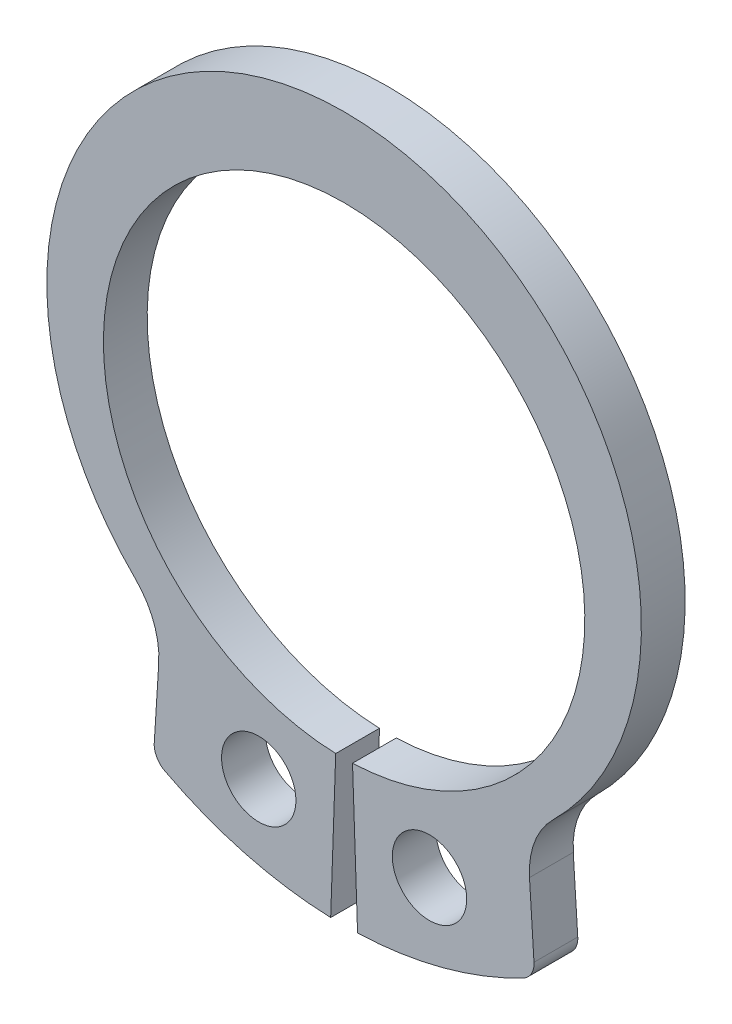
ISO-10303-21;
HEADER;
FILE_DESCRIPTION(('STEP AP214'),'2;1');
FILE_NAME('part.step','',(''),(''),'','','');
FILE_SCHEMA(('AUTOMOTIVE_DESIGN { 1 0 10303 214 1 1 1 1 }'));
ENDSEC;
DATA;
#1=APPLICATION_CONTEXT('core data for automotive mechanical design processes');
#2=APPLICATION_PROTOCOL_DEFINITION('international standard','automotive_design',2000,#1);
#3=PRODUCT_CONTEXT('',#1,'mechanical');
#4=PRODUCT('Part','Part','',(#3));
#5=PRODUCT_RELATED_PRODUCT_CATEGORY('part','',(#4));
#6=PRODUCT_DEFINITION_FORMATION('','',#4);
#7=PRODUCT_DEFINITION_CONTEXT('part definition',#1,'design');
#8=PRODUCT_DEFINITION('design','',#6,#7);
#9=PRODUCT_DEFINITION_SHAPE('','',#8);
#10=(LENGTH_UNIT() NAMED_UNIT(*) SI_UNIT(.MILLI.,.METRE.));
#11=(NAMED_UNIT(*) PLANE_ANGLE_UNIT() SI_UNIT($,.RADIAN.));
#12=(NAMED_UNIT(*) SI_UNIT($,.STERADIAN.) SOLID_ANGLE_UNIT());
#13=UNCERTAINTY_MEASURE_WITH_UNIT(LENGTH_MEASURE(1.E-05),#10,'distance_accuracy_value','');
#14=(GEOMETRIC_REPRESENTATION_CONTEXT(3) GLOBAL_UNCERTAINTY_ASSIGNED_CONTEXT((#13)) GLOBAL_UNIT_ASSIGNED_CONTEXT((#10,
#11,#12)) REPRESENTATION_CONTEXT('',''));
#15=CARTESIAN_POINT('',(0.,0.,0.));
#16=DIRECTION('',(0.,0.,1.));
#17=DIRECTION('',(1.,0.,0.));
#18=AXIS2_PLACEMENT_3D('',#15,#16,#17);
#19=CARTESIAN_POINT('',(0.,0.507545005992358,0.5));
#20=DIRECTION('',(0.,0.,1.));
#21=DIRECTION('',(1.,0.,0.));
#22=AXIS2_PLACEMENT_3D('',#19,#20,#21);
#23=PLANE('',#22);
#24=DIRECTION('',(-0.0629534404343127,-0.99801646496312,0.));
#25=VECTOR('',#24,1.);
#26=CARTESIAN_POINT('',(-4.3566053068115,-7.6520863294954,0.5));
#27=LINE('',#26,#25);
#28=CARTESIAN_POINT('',(-4.23583263948221,-5.73744735693751,0.5));
#29=VERTEX_POINT('',#28);
#30=CARTESIAN_POINT('',(-4.33832534093224,-7.36228950821608,0.5));
#31=VERTEX_POINT('',#30);
#32=EDGE_CURVE('E191',#29,#31,#27,.T.);
#33=ORIENTED_EDGE('',*,*,#32,.T.);
#34=CARTESIAN_POINT('',(-3.88266616370929,-7.39103183249498,0.5));
#35=DIRECTION('',(0.,0.,1.));
#36=DIRECTION('',(1.,0.,0.));
#37=AXIS2_PLACEMENT_3D('',#34,#35,#36);
#38=CIRCLE('',#37,0.456564789479487);
#39=CARTESIAN_POINT('',(-4.09499474140208,-7.79521988537063,0.5));
#40=VERTEX_POINT('',#39);
#41=EDGE_CURVE('E12',#31,#40,#38,.T.);
#42=ORIENTED_EDGE('',*,*,#41,.T.);
#43=CARTESIAN_POINT('',(0.,0.,0.5));
#44=DIRECTION('',(0.,0.,1.));
#45=DIRECTION('',(1.,0.,0.));
#46=AXIS2_PLACEMENT_3D('',#43,#44,#45);
#47=CIRCLE('',#46,8.80536398982963);
#48=CARTESIAN_POINT('',(-0.307302771527394,-8.8,0.5));
#49=VERTEX_POINT('',#48);
#50=EDGE_CURVE('E194',#40,#49,#47,.T.);
#51=ORIENTED_EDGE('',*,*,#50,.T.);
#52=DIRECTION('',(0.0348994967025025,0.999390827019096,0.));
#53=VECTOR('',#52,1.);
#54=CARTESIAN_POINT('',(-0.307302771527394,-8.8,0.5));
#55=LINE('',#54,#53);
#56=CARTESIAN_POINT('',(-0.191947231863764,-5.49664954860503,0.5));
#57=VERTEX_POINT('',#56);
#58=EDGE_CURVE('E196',#49,#57,#55,.T.);
#59=ORIENTED_EDGE('',*,*,#58,.T.);
#60=CARTESIAN_POINT('',(0.,0.,0.5));
#61=DIRECTION('',(0.,0.,-1.));
#62=DIRECTION('',(1.,0.,0.));
#63=AXIS2_PLACEMENT_3D('',#60,#61,#62);
#64=CIRCLE('',#63,5.5);
#65=CARTESIAN_POINT('',(0.191947231863761,-5.49664954860503,0.5));
#66=VERTEX_POINT('',#65);
#67=EDGE_CURVE('E150',#57,#66,#64,.T.);
#68=ORIENTED_EDGE('',*,*,#67,.T.);
#69=DIRECTION('',(-0.034899496702502,0.999390827019096,0.));
#70=VECTOR('',#69,1.);
#71=CARTESIAN_POINT('',(0.30730277152739,-8.8,0.5));
#72=LINE('',#71,#70);
#73=CARTESIAN_POINT('',(0.30730277152739,-8.8,0.5));
#74=VERTEX_POINT('',#73);
#75=EDGE_CURVE('E130',#74,#66,#72,.T.);
#76=ORIENTED_EDGE('',*,*,#75,.F.);
#77=CARTESIAN_POINT('',(0.,0.,0.5));
#78=DIRECTION('',(0.,0.,-1.));
#79=DIRECTION('',(-1.,0.,0.));
#80=AXIS2_PLACEMENT_3D('',#77,#78,#79);
#81=CIRCLE('',#80,8.80536398982963);
#82=CARTESIAN_POINT('',(4.09499474140208,-7.79521988537063,0.5));
#83=VERTEX_POINT('',#82);
#84=EDGE_CURVE('E140',#83,#74,#81,.T.);
#85=ORIENTED_EDGE('',*,*,#84,.F.);
#86=CARTESIAN_POINT('',(3.88266616370929,-7.39103183249499,0.5));
#87=DIRECTION('',(0.,0.,-1.));
#88=DIRECTION('',(-1.,0.,0.));
#89=AXIS2_PLACEMENT_3D('',#86,#87,#88);
#90=CIRCLE('',#89,0.456564789479487);
#91=CARTESIAN_POINT('',(4.33832534093224,-7.36228950821608,0.5));
#92=VERTEX_POINT('',#91);
#93=EDGE_CURVE('E179',#92,#83,#90,.T.);
#94=ORIENTED_EDGE('',*,*,#93,.F.);
#95=DIRECTION('',(0.0629534404343122,-0.99801646496312,0.));
#96=VECTOR('',#95,1.);
#97=CARTESIAN_POINT('',(4.35660530681149,-7.6520863294954,0.5));
#98=LINE('',#97,#96);
#99=CARTESIAN_POINT('',(4.23583263948221,-5.73744735693752,0.5));
#100=VERTEX_POINT('',#99);
#101=EDGE_CURVE('E146',#100,#92,#98,.T.);
#102=ORIENTED_EDGE('',*,*,#101,.F.);
#103=CARTESIAN_POINT('',(6.05846934837401,-5.62247805982191,0.5));
#104=DIRECTION('',(0.,0.,-1.));
#105=DIRECTION('',(-1.,0.,0.));
#106=AXIS2_PLACEMENT_3D('',#103,#104,#105);
#107=CIRCLE('',#106,1.82625915791795);
#108=CARTESIAN_POINT('',(4.77471228956017,-4.32355915325968,0.5));
#109=VERTEX_POINT('',#108);
#110=EDGE_CURVE('E170',#109,#100,#107,.F.);
#111=ORIENTED_EDGE('',*,*,#110,.F.);
#112=CARTESIAN_POINT('',(0.,0.507545005992358,0.5));
#113=DIRECTION('',(0.,0.,1.));
#114=DIRECTION('',(1.,0.,0.));
#115=AXIS2_PLACEMENT_3D('',#112,#113,#114);
#116=CIRCLE('',#115,6.79245499400764);
#117=CARTESIAN_POINT('',(-4.77471228956017,-4.32355915325968,0.5));
#118=VERTEX_POINT('',#117);
#119=EDGE_CURVE('E188',#109,#118,#116,.T.);
#120=ORIENTED_EDGE('',*,*,#119,.T.);
#121=CARTESIAN_POINT('',(-6.05846934837401,-5.62247805982191,0.5));
#122=DIRECTION('',(0.,0.,1.));
#123=DIRECTION('',(1.,0.,0.));
#124=AXIS2_PLACEMENT_3D('',#121,#122,#123);
#125=CIRCLE('',#124,1.82625915791795);
#126=EDGE_CURVE('E221',#118,#29,#125,.F.);
#127=ORIENTED_EDGE('',*,*,#126,.T.);
#128=EDGE_LOOP('',(#33,#42,#51,#59,#68,#76,#85,#94,#102,#111,#120,#127));
#129=FACE_BOUND('',#128,.T.);
#130=CARTESIAN_POINT('',(-1.95080113253433,-6.88151398034483,0.5));
#131=DIRECTION('',(0.,0.,1.));
#132=DIRECTION('',(1.,0.,0.));
#133=AXIS2_PLACEMENT_3D('',#130,#131,#132);
#134=CIRCLE('',#133,0.85);
#135=CARTESIAN_POINT('',(-1.10080113253433,-6.88151398034483,0.5));
#136=VERTEX_POINT('',#135);
#137=EDGE_CURVE('E182',#136,#136,#134,.T.);
#138=ORIENTED_EDGE('',*,*,#137,.F.);
#139=EDGE_LOOP('',(#138));
#140=FACE_BOUND('',#139,.T.);
#141=CARTESIAN_POINT('',(1.95080113253433,-6.88151398034483,0.5));
#142=DIRECTION('',(0.,0.,-1.));
#143=DIRECTION('',(-1.,0.,0.));
#144=AXIS2_PLACEMENT_3D('',#141,#142,#143);
#145=CIRCLE('',#144,0.85);
#146=CARTESIAN_POINT('',(1.10080113253433,-6.88151398034483,0.5));
#147=VERTEX_POINT('',#146);
#148=EDGE_CURVE('E160',#147,#147,#145,.T.);
#149=ORIENTED_EDGE('',*,*,#148,.T.);
#150=EDGE_LOOP('',(#149));
#151=FACE_BOUND('',#150,.T.);
#152=ADVANCED_FACE('F36',(#129,#140,#151),#23,.T.);
#153=CARTESIAN_POINT('',(0.,0.507545005992358,-0.5));
#154=DIRECTION('',(0.,0.,1.));
#155=DIRECTION('',(1.,0.,0.));
#156=AXIS2_PLACEMENT_3D('',#153,#154,#155);
#157=PLANE('',#156);
#158=CARTESIAN_POINT('',(0.,0.,-0.5));
#159=DIRECTION('',(0.,0.,1.));
#160=DIRECTION('',(1.,0.,0.));
#161=AXIS2_PLACEMENT_3D('',#158,#159,#160);
#162=CIRCLE('',#161,8.80536398982963);
#163=CARTESIAN_POINT('',(-4.09499474140208,-7.79521988537063,-0.5));
#164=VERTEX_POINT('',#163);
#165=CARTESIAN_POINT('',(-0.307302771527394,-8.8,-0.5));
#166=VERTEX_POINT('',#165);
#167=EDGE_CURVE('E204',#164,#166,#162,.T.);
#168=ORIENTED_EDGE('',*,*,#167,.F.);
#169=CARTESIAN_POINT('',(-3.88266616370929,-7.39103183249498,-0.5));
#170=DIRECTION('',(0.,0.,1.));
#171=DIRECTION('',(1.,0.,0.));
#172=AXIS2_PLACEMENT_3D('',#169,#170,#171);
#173=CIRCLE('',#172,0.456564789479487);
#174=CARTESIAN_POINT('',(-4.33832534093224,-7.36228950821608,-0.5));
#175=VERTEX_POINT('',#174);
#176=EDGE_CURVE('E58',#164,#175,#173,.F.);
#177=ORIENTED_EDGE('',*,*,#176,.T.);
#178=DIRECTION('',(-0.0629534404343127,-0.99801646496312,0.));
#179=VECTOR('',#178,1.);
#180=CARTESIAN_POINT('',(-4.3566053068115,-7.6520863294954,-0.5));
#181=LINE('',#180,#179);
#182=CARTESIAN_POINT('',(-4.23583263948221,-5.73744735693751,-0.5));
#183=VERTEX_POINT('',#182);
#184=EDGE_CURVE('E202',#183,#175,#181,.T.);
#185=ORIENTED_EDGE('',*,*,#184,.F.);
#186=CARTESIAN_POINT('',(-6.05846934837401,-5.62247805982191,-0.5));
#187=DIRECTION('',(0.,0.,1.));
#188=DIRECTION('',(1.,0.,0.));
#189=AXIS2_PLACEMENT_3D('',#186,#187,#188);
#190=CIRCLE('',#189,1.82625915791795);
#191=CARTESIAN_POINT('',(-4.77471228956017,-4.32355915325968,-0.5));
#192=VERTEX_POINT('',#191);
#193=EDGE_CURVE('E219',#183,#192,#190,.T.);
#194=ORIENTED_EDGE('',*,*,#193,.T.);
#195=CARTESIAN_POINT('',(0.,0.507545005992358,-0.5));
#196=DIRECTION('',(0.,0.,1.));
#197=DIRECTION('',(1.,0.,0.));
#198=AXIS2_PLACEMENT_3D('',#195,#196,#197);
#199=CIRCLE('',#198,6.79245499400764);
#200=CARTESIAN_POINT('',(4.77471228956017,-4.32355915325968,-0.5));
#201=VERTEX_POINT('',#200);
#202=EDGE_CURVE('E185',#201,#192,#199,.T.);
#203=ORIENTED_EDGE('',*,*,#202,.F.);
#204=CARTESIAN_POINT('',(6.05846934837401,-5.62247805982191,-0.5));
#205=DIRECTION('',(0.,0.,-1.));
#206=DIRECTION('',(-1.,0.,0.));
#207=AXIS2_PLACEMENT_3D('',#204,#205,#206);
#208=CIRCLE('',#207,1.82625915791795);
#209=CARTESIAN_POINT('',(4.23583263948221,-5.73744735693752,-0.5));
#210=VERTEX_POINT('',#209);
#211=EDGE_CURVE('E167',#210,#201,#208,.T.);
#212=ORIENTED_EDGE('',*,*,#211,.F.);
#213=DIRECTION('',(0.0629534404343122,-0.99801646496312,0.));
#214=VECTOR('',#213,1.);
#215=CARTESIAN_POINT('',(4.35660530681149,-7.6520863294954,-0.5));
#216=LINE('',#215,#214);
#217=CARTESIAN_POINT('',(4.33832534093224,-7.36228950821608,-0.5));
#218=VERTEX_POINT('',#217);
#219=EDGE_CURVE('E156',#210,#218,#216,.T.);
#220=ORIENTED_EDGE('',*,*,#219,.T.);
#221=CARTESIAN_POINT('',(3.88266616370929,-7.39103183249499,-0.5));
#222=DIRECTION('',(0.,0.,-1.));
#223=DIRECTION('',(-1.,0.,0.));
#224=AXIS2_PLACEMENT_3D('',#221,#222,#223);
#225=CIRCLE('',#224,0.456564789479487);
#226=CARTESIAN_POINT('',(4.09499474140208,-7.79521988537063,-0.5));
#227=VERTEX_POINT('',#226);
#228=EDGE_CURVE('E174',#227,#218,#225,.F.);
#229=ORIENTED_EDGE('',*,*,#228,.F.);
#230=CARTESIAN_POINT('',(0.,0.,-0.5));
#231=DIRECTION('',(0.,0.,-1.));
#232=DIRECTION('',(-1.,0.,0.));
#233=AXIS2_PLACEMENT_3D('',#230,#231,#232);
#234=CIRCLE('',#233,8.80536398982963);
#235=CARTESIAN_POINT('',(0.30730277152739,-8.8,-0.5));
#236=VERTEX_POINT('',#235);
#237=EDGE_CURVE('E159',#227,#236,#234,.T.);
#238=ORIENTED_EDGE('',*,*,#237,.T.);
#239=DIRECTION('',(-0.034899496702502,0.999390827019096,0.));
#240=VECTOR('',#239,1.);
#241=CARTESIAN_POINT('',(0.30730277152739,-8.8,-0.5));
#242=LINE('',#241,#240);
#243=CARTESIAN_POINT('',(0.191947231863761,-5.49664954860503,-0.5));
#244=VERTEX_POINT('',#243);
#245=EDGE_CURVE('E132',#236,#244,#242,.T.);
#246=ORIENTED_EDGE('',*,*,#245,.T.);
#247=CARTESIAN_POINT('',(0.,0.,-0.5));
#248=DIRECTION('',(0.,0.,-1.));
#249=DIRECTION('',(1.,0.,0.));
#250=AXIS2_PLACEMENT_3D('',#247,#248,#249);
#251=CIRCLE('',#250,5.5);
#252=CARTESIAN_POINT('',(-0.191947231863764,-5.49664954860503,-0.5));
#253=VERTEX_POINT('',#252);
#254=EDGE_CURVE('E192',#253,#244,#251,.T.);
#255=ORIENTED_EDGE('',*,*,#254,.F.);
#256=DIRECTION('',(0.0348994967025025,0.999390827019096,0.));
#257=VECTOR('',#256,1.);
#258=CARTESIAN_POINT('',(-0.307302771527394,-8.8,-0.5));
#259=LINE('',#258,#257);
#260=EDGE_CURVE('E206',#166,#253,#259,.T.);
#261=ORIENTED_EDGE('',*,*,#260,.F.);
#262=EDGE_LOOP('',(#168,#177,#185,#194,#203,#212,#220,#229,#238,#246,#255,#261));
#263=FACE_BOUND('',#262,.T.);
#264=CARTESIAN_POINT('',(-1.95080113253433,-6.88151398034483,-0.5));
#265=DIRECTION('',(0.,0.,1.));
#266=DIRECTION('',(1.,0.,0.));
#267=AXIS2_PLACEMENT_3D('',#264,#265,#266);
#268=CIRCLE('',#267,0.85);
#269=CARTESIAN_POINT('',(-1.10080113253433,-6.88151398034483,-0.5));
#270=VERTEX_POINT('',#269);
#271=EDGE_CURVE('E181',#270,#270,#268,.T.);
#272=ORIENTED_EDGE('',*,*,#271,.T.);
#273=EDGE_LOOP('',(#272));
#274=FACE_BOUND('',#273,.T.);
#275=CARTESIAN_POINT('',(1.95080113253433,-6.88151398034483,-0.5));
#276=DIRECTION('',(0.,0.,-1.));
#277=DIRECTION('',(-1.,0.,0.));
#278=AXIS2_PLACEMENT_3D('',#275,#276,#277);
#279=CIRCLE('',#278,0.85);
#280=CARTESIAN_POINT('',(1.10080113253433,-6.88151398034483,-0.5));
#281=VERTEX_POINT('',#280);
#282=EDGE_CURVE('E254',#281,#281,#279,.T.);
#283=ORIENTED_EDGE('',*,*,#282,.F.);
#284=EDGE_LOOP('',(#283));
#285=FACE_BOUND('',#284,.T.);
#286=ADVANCED_FACE('F234',(#263,#274,#285),#157,.F.);
#287=CARTESIAN_POINT('',(0.,0.507545005992358,0.5));
#288=DIRECTION('',(0.,0.,-1.));
#289=DIRECTION('',(-1.,0.,0.));
#290=AXIS2_PLACEMENT_3D('',#287,#288,#289);
#291=CYLINDRICAL_SURFACE('',#290,6.79245499400764);
#292=ORIENTED_EDGE('',*,*,#202,.T.);
#293=DIRECTION('',(0.,0.,-1.));
#294=VECTOR('',#293,1.);
#295=CARTESIAN_POINT('',(-4.77471228956017,-4.32355915325968,0.5));
#296=LINE('',#295,#294);
#297=EDGE_CURVE('E217',#192,#118,#296,.F.);
#298=ORIENTED_EDGE('',*,*,#297,.T.);
#299=ORIENTED_EDGE('',*,*,#119,.F.);
#300=DIRECTION('',(0.,0.,-1.));
#301=VECTOR('',#300,1.);
#302=CARTESIAN_POINT('',(4.77471228956017,-4.32355915325968,0.5));
#303=LINE('',#302,#301);
#304=EDGE_CURVE('E164',#201,#109,#303,.F.);
#305=ORIENTED_EDGE('',*,*,#304,.F.);
#306=EDGE_LOOP('',(#292,#298,#299,#305));
#307=FACE_BOUND('',#306,.T.);
#308=ADVANCED_FACE('F269',(#307),#291,.T.);
#309=CARTESIAN_POINT('',(-4.3566053068115,-7.6520863294954,0.5));
#310=DIRECTION('',(0.998016464963121,-0.0629534404343127,0.));
#311=DIRECTION('',(0.0629534404343127,0.998016464963121,0.));
#312=AXIS2_PLACEMENT_3D('',#309,#310,#311);
#313=PLANE('',#312);
#314=ORIENTED_EDGE('',*,*,#184,.T.);
#315=DIRECTION('',(0.,0.,-1.));
#316=VECTOR('',#315,1.);
#317=CARTESIAN_POINT('',(-4.33832534093224,-7.36228950821608,0.5));
#318=LINE('',#317,#316);
#319=EDGE_CURVE('E44',#175,#31,#318,.F.);
#320=ORIENTED_EDGE('',*,*,#319,.T.);
#321=ORIENTED_EDGE('',*,*,#32,.F.);
#322=DIRECTION('',(0.,0.,1.));
#323=VECTOR('',#322,1.);
#324=CARTESIAN_POINT('',(-4.23583263948221,-5.73744735693751,-0.5));
#325=LINE('',#324,#323);
#326=EDGE_CURVE('E214',#29,#183,#325,.F.);
#327=ORIENTED_EDGE('',*,*,#326,.T.);
#328=EDGE_LOOP('',(#314,#320,#321,#327));
#329=FACE_BOUND('',#328,.T.);
#330=ADVANCED_FACE('F275',(#329),#313,.F.);
#331=CARTESIAN_POINT('',(0.,0.,0.5));
#332=DIRECTION('',(0.,0.,-1.));
#333=DIRECTION('',(-1.,0.,0.));
#334=AXIS2_PLACEMENT_3D('',#331,#332,#333);
#335=CYLINDRICAL_SURFACE('',#334,8.80536398982963);
#336=ORIENTED_EDGE('',*,*,#50,.F.);
#337=DIRECTION('',(0.,0.,-1.));
#338=VECTOR('',#337,1.);
#339=CARTESIAN_POINT('',(-4.09499474140208,-7.79521988537063,0.5));
#340=LINE('',#339,#338);
#341=EDGE_CURVE('E223',#40,#164,#340,.T.);
#342=ORIENTED_EDGE('',*,*,#341,.T.);
#343=ORIENTED_EDGE('',*,*,#167,.T.);
#344=DIRECTION('',(0.,0.,-1.));
#345=VECTOR('',#344,1.);
#346=CARTESIAN_POINT('',(-0.307302771527394,-8.8,0.5));
#347=LINE('',#346,#345);
#348=EDGE_CURVE('E211',#49,#166,#347,.T.);
#349=ORIENTED_EDGE('',*,*,#348,.F.);
#350=EDGE_LOOP('',(#336,#342,#343,#349));
#351=FACE_BOUND('',#350,.T.);
#352=ADVANCED_FACE('F229',(#351),#335,.T.);
#353=CARTESIAN_POINT('',(-0.307302771527394,-8.8,0.5));
#354=DIRECTION('',(-0.999390827019096,0.0348994967025025,0.));
#355=DIRECTION('',(-0.0348994967025025,-0.999390827019096,0.));
#356=AXIS2_PLACEMENT_3D('',#353,#354,#355);
#357=PLANE('',#356);
#358=ORIENTED_EDGE('',*,*,#260,.T.);
#359=DIRECTION('',(0.,0.,-1.));
#360=VECTOR('',#359,1.);
#361=CARTESIAN_POINT('',(-0.191947231863764,-5.49664954860503,0.5));
#362=LINE('',#361,#360);
#363=EDGE_CURVE('E199',#57,#253,#362,.T.);
#364=ORIENTED_EDGE('',*,*,#363,.F.);
#365=ORIENTED_EDGE('',*,*,#58,.F.);
#366=ORIENTED_EDGE('',*,*,#348,.T.);
#367=EDGE_LOOP('',(#358,#364,#365,#366));
#368=FACE_BOUND('',#367,.T.);
#369=ADVANCED_FACE('F239',(#368),#357,.F.);
#370=CARTESIAN_POINT('',(0.,0.,0.5));
#371=DIRECTION('',(0.,0.,-1.));
#372=DIRECTION('',(-1.,0.,0.));
#373=AXIS2_PLACEMENT_3D('',#370,#371,#372);
#374=CYLINDRICAL_SURFACE('',#373,5.5);
#375=ORIENTED_EDGE('',*,*,#254,.T.);
#376=DIRECTION('',(0.,0.,-1.));
#377=VECTOR('',#376,1.);
#378=CARTESIAN_POINT('',(0.191947231863761,-5.49664954860503,0.5));
#379=LINE('',#378,#377);
#380=EDGE_CURVE('E137',#66,#244,#379,.T.);
#381=ORIENTED_EDGE('',*,*,#380,.F.);
#382=ORIENTED_EDGE('',*,*,#67,.F.);
#383=ORIENTED_EDGE('',*,*,#363,.T.);
#384=EDGE_LOOP('',(#375,#381,#382,#383));
#385=FACE_BOUND('',#384,.T.);
#386=ADVANCED_FACE('F242',(#385),#374,.F.);
#387=CARTESIAN_POINT('',(-1.95080113253433,-6.88151398034483,0.5));
#388=DIRECTION('',(0.,0.,-1.));
#389=DIRECTION('',(-1.,0.,0.));
#390=AXIS2_PLACEMENT_3D('',#387,#388,#389);
#391=CYLINDRICAL_SURFACE('',#390,0.85);
#392=ORIENTED_EDGE('',*,*,#137,.T.);
#393=EDGE_LOOP('',(#392));
#394=FACE_BOUND('',#393,.T.);
#395=ORIENTED_EDGE('',*,*,#271,.F.);
#396=EDGE_LOOP('',(#395));
#397=FACE_BOUND('',#396,.T.);
#398=ADVANCED_FACE('F283',(#394,#397),#391,.F.);
#399=CARTESIAN_POINT('',(-6.05846934837401,-5.62247805982191,0.5));
#400=DIRECTION('',(0.,0.,-1.));
#401=DIRECTION('',(-1.,0.,0.));
#402=AXIS2_PLACEMENT_3D('',#399,#400,#401);
#403=CYLINDRICAL_SURFACE('',#402,1.82625915791795);
#404=ORIENTED_EDGE('',*,*,#126,.F.);
#405=ORIENTED_EDGE('',*,*,#297,.F.);
#406=ORIENTED_EDGE('',*,*,#193,.F.);
#407=ORIENTED_EDGE('',*,*,#326,.F.);
#408=EDGE_LOOP('',(#404,#405,#406,#407));
#409=FACE_BOUND('',#408,.T.);
#410=ADVANCED_FACE('F289',(#409),#403,.F.);
#411=CARTESIAN_POINT('',(-3.88266616370929,-7.39103183249498,0.5));
#412=DIRECTION('',(0.,0.,-1.));
#413=DIRECTION('',(-1.,0.,0.));
#414=AXIS2_PLACEMENT_3D('',#411,#412,#413);
#415=CYLINDRICAL_SURFACE('',#414,0.456564789479487);
#416=ORIENTED_EDGE('',*,*,#41,.F.);
#417=ORIENTED_EDGE('',*,*,#319,.F.);
#418=ORIENTED_EDGE('',*,*,#176,.F.);
#419=ORIENTED_EDGE('',*,*,#341,.F.);
#420=EDGE_LOOP('',(#416,#417,#418,#419));
#421=FACE_BOUND('',#420,.T.);
#422=ADVANCED_FACE('F38',(#421),#415,.T.);
#423=CARTESIAN_POINT('',(4.35660530681149,-7.6520863294954,0.5));
#424=DIRECTION('',(-0.998016464963121,-0.0629534404343122,0.));
#425=DIRECTION('',(-0.0629534404343122,0.998016464963121,0.));
#426=AXIS2_PLACEMENT_3D('',#423,#424,#425);
#427=PLANE('',#426);
#428=ORIENTED_EDGE('',*,*,#219,.F.);
#429=DIRECTION('',(0.,0.,1.));
#430=VECTOR('',#429,1.);
#431=CARTESIAN_POINT('',(4.23583263948221,-5.73744735693752,-0.5));
#432=LINE('',#431,#430);
#433=EDGE_CURVE('E136',#100,#210,#432,.F.);
#434=ORIENTED_EDGE('',*,*,#433,.F.);
#435=ORIENTED_EDGE('',*,*,#101,.T.);
#436=DIRECTION('',(0.,0.,-1.));
#437=VECTOR('',#436,1.);
#438=CARTESIAN_POINT('',(4.33832534093224,-7.36228950821608,0.5));
#439=LINE('',#438,#437);
#440=EDGE_CURVE('E177',#218,#92,#439,.F.);
#441=ORIENTED_EDGE('',*,*,#440,.F.);
#442=EDGE_LOOP('',(#428,#434,#435,#441));
#443=FACE_BOUND('',#442,.T.);
#444=ADVANCED_FACE('F252',(#443),#427,.F.);
#445=CARTESIAN_POINT('',(0.,0.,0.5));
#446=DIRECTION('',(0.,0.,-1.));
#447=DIRECTION('',(1.,0.,0.));
#448=AXIS2_PLACEMENT_3D('',#445,#446,#447);
#449=CYLINDRICAL_SURFACE('',#448,8.80536398982963);
#450=ORIENTED_EDGE('',*,*,#84,.T.);
#451=DIRECTION('',(0.,0.,-1.));
#452=VECTOR('',#451,1.);
#453=CARTESIAN_POINT('',(0.30730277152739,-8.8,0.5));
#454=LINE('',#453,#452);
#455=EDGE_CURVE('E125',#74,#236,#454,.T.);
#456=ORIENTED_EDGE('',*,*,#455,.T.);
#457=ORIENTED_EDGE('',*,*,#237,.F.);
#458=DIRECTION('',(0.,0.,-1.));
#459=VECTOR('',#458,1.);
#460=CARTESIAN_POINT('',(4.09499474140208,-7.79521988537063,0.5));
#461=LINE('',#460,#459);
#462=EDGE_CURVE('E142',#83,#227,#461,.T.);
#463=ORIENTED_EDGE('',*,*,#462,.F.);
#464=EDGE_LOOP('',(#450,#456,#457,#463));
#465=FACE_BOUND('',#464,.T.);
#466=ADVANCED_FACE('F141',(#465),#449,.T.);
#467=CARTESIAN_POINT('',(0.30730277152739,-8.8,0.5));
#468=DIRECTION('',(0.999390827019096,0.034899496702502,0.));
#469=DIRECTION('',(0.034899496702502,-0.999390827019096,0.));
#470=AXIS2_PLACEMENT_3D('',#467,#468,#469);
#471=PLANE('',#470);
#472=ORIENTED_EDGE('',*,*,#245,.F.);
#473=ORIENTED_EDGE('',*,*,#455,.F.);
#474=ORIENTED_EDGE('',*,*,#75,.T.);
#475=ORIENTED_EDGE('',*,*,#380,.T.);
#476=EDGE_LOOP('',(#472,#473,#474,#475));
#477=FACE_BOUND('',#476,.T.);
#478=ADVANCED_FACE('F127',(#477),#471,.F.);
#479=CARTESIAN_POINT('',(1.95080113253433,-6.88151398034483,0.5));
#480=DIRECTION('',(0.,0.,-1.));
#481=DIRECTION('',(1.,0.,0.));
#482=AXIS2_PLACEMENT_3D('',#479,#480,#481);
#483=CYLINDRICAL_SURFACE('',#482,0.85);
#484=ORIENTED_EDGE('',*,*,#148,.F.);
#485=EDGE_LOOP('',(#484));
#486=FACE_BOUND('',#485,.T.);
#487=ORIENTED_EDGE('',*,*,#282,.T.);
#488=EDGE_LOOP('',(#487));
#489=FACE_BOUND('',#488,.T.);
#490=ADVANCED_FACE('F261',(#486,#489),#483,.F.);
#491=CARTESIAN_POINT('',(6.05846934837401,-5.62247805982191,0.5));
#492=DIRECTION('',(0.,0.,-1.));
#493=DIRECTION('',(1.,0.,0.));
#494=AXIS2_PLACEMENT_3D('',#491,#492,#493);
#495=CYLINDRICAL_SURFACE('',#494,1.82625915791795);
#496=ORIENTED_EDGE('',*,*,#110,.T.);
#497=ORIENTED_EDGE('',*,*,#433,.T.);
#498=ORIENTED_EDGE('',*,*,#211,.T.);
#499=ORIENTED_EDGE('',*,*,#304,.T.);
#500=EDGE_LOOP('',(#496,#497,#498,#499));
#501=FACE_BOUND('',#500,.T.);
#502=ADVANCED_FACE('F264',(#501),#495,.F.);
#503=CARTESIAN_POINT('',(3.88266616370929,-7.39103183249499,0.5));
#504=DIRECTION('',(0.,0.,-1.));
#505=DIRECTION('',(1.,0.,0.));
#506=AXIS2_PLACEMENT_3D('',#503,#504,#505);
#507=CYLINDRICAL_SURFACE('',#506,0.456564789479487);
#508=ORIENTED_EDGE('',*,*,#93,.T.);
#509=ORIENTED_EDGE('',*,*,#462,.T.);
#510=ORIENTED_EDGE('',*,*,#228,.T.);
#511=ORIENTED_EDGE('',*,*,#440,.T.);
#512=EDGE_LOOP('',(#508,#509,#510,#511));
#513=FACE_BOUND('',#512,.T.);
#514=ADVANCED_FACE('F247',(#513),#507,.T.);
#515=CLOSED_SHELL('',(#152,#286,#308,#330,#352,#369,#386,#398,#410,#422,#444,#466,#478,#490,
#502,#514));
#516=MANIFOLD_SOLID_BREP('B2',#515);
#517=ADVANCED_BREP_SHAPE_REPRESENTATION('',(#18,#516),#14);
#518=SHAPE_DEFINITION_REPRESENTATION(#9,#517);
ENDSEC;
END-ISO-10303-21;
